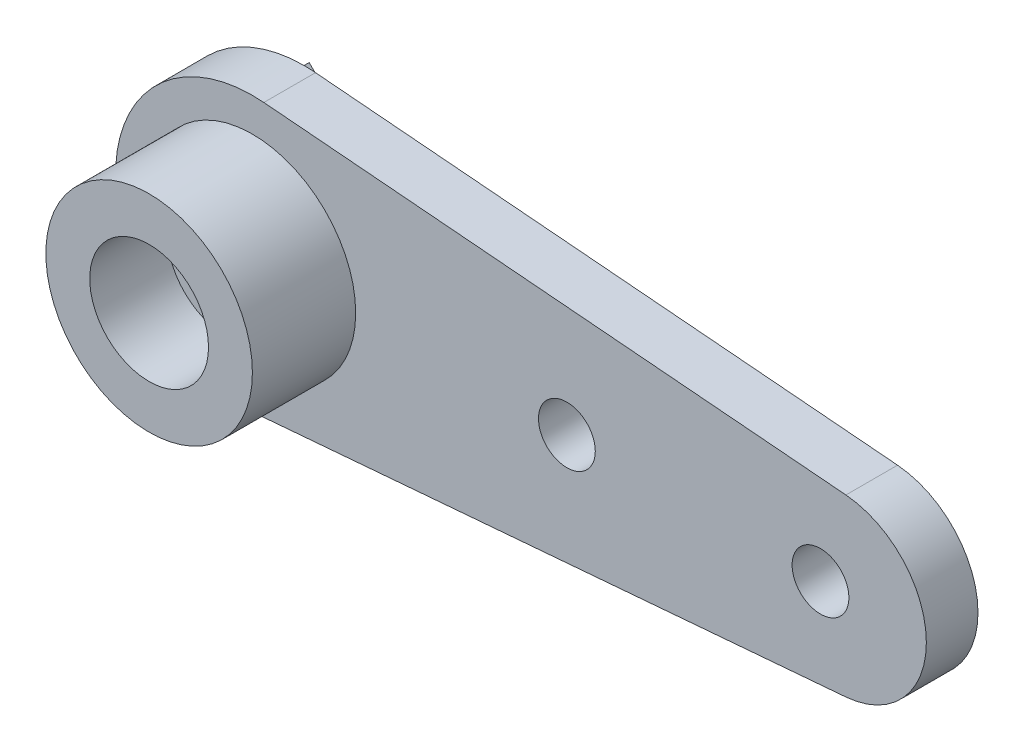
ISO-10303-21;
HEADER;
FILE_DESCRIPTION(('STEP AP214'),'2;1');
FILE_NAME('part.step','',(''),(''),'','','');
FILE_SCHEMA(('AUTOMOTIVE_DESIGN { 1 0 10303 214 1 1 1 1 }'));
ENDSEC;
DATA;
#1=APPLICATION_CONTEXT('core data for automotive mechanical design processes');
#2=APPLICATION_PROTOCOL_DEFINITION('international standard','automotive_design',2000,#1);
#3=PRODUCT_CONTEXT('',#1,'mechanical');
#4=PRODUCT('Part','Part','',(#3));
#5=PRODUCT_RELATED_PRODUCT_CATEGORY('part','',(#4));
#6=PRODUCT_DEFINITION_FORMATION('','',#4);
#7=PRODUCT_DEFINITION_CONTEXT('part definition',#1,'design');
#8=PRODUCT_DEFINITION('design','',#6,#7);
#9=PRODUCT_DEFINITION_SHAPE('','',#8);
#10=(LENGTH_UNIT() NAMED_UNIT(*) SI_UNIT(.MILLI.,.METRE.));
#11=(NAMED_UNIT(*) PLANE_ANGLE_UNIT() SI_UNIT($,.RADIAN.));
#12=(NAMED_UNIT(*) SI_UNIT($,.STERADIAN.) SOLID_ANGLE_UNIT());
#13=UNCERTAINTY_MEASURE_WITH_UNIT(LENGTH_MEASURE(1.E-05),#10,'distance_accuracy_value','');
#14=(GEOMETRIC_REPRESENTATION_CONTEXT(3) GLOBAL_UNCERTAINTY_ASSIGNED_CONTEXT((#13)) GLOBAL_UNIT_ASSIGNED_CONTEXT((#10,
#11,#12)) REPRESENTATION_CONTEXT('',''));
#15=CARTESIAN_POINT('',(0.,0.,0.));
#16=DIRECTION('',(0.,0.,1.));
#17=DIRECTION('',(1.,0.,0.));
#18=AXIS2_PLACEMENT_3D('',#15,#16,#17);
#19=CARTESIAN_POINT('',(0.,0.,0.));
#20=DIRECTION('',(0.,0.,1.));
#21=DIRECTION('',(1.,0.,0.));
#22=AXIS2_PLACEMENT_3D('',#19,#20,#21);
#23=PLANE('',#22);
#24=CARTESIAN_POINT('',(27.9406442711304,0.,0.));
#25=DIRECTION('',(0.,0.,1.));
#26=DIRECTION('',(1.,0.,0.));
#27=AXIS2_PLACEMENT_3D('',#24,#25,#26);
#28=CIRCLE('',#27,1.397);
#29=CARTESIAN_POINT('',(29.3376442711304,0.,0.));
#30=VERTEX_POINT('',#29);
#31=EDGE_CURVE('E169',#30,#30,#28,.T.);
#32=ORIENTED_EDGE('',*,*,#31,.T.);
#33=EDGE_LOOP('',(#32));
#34=FACE_BOUND('',#33,.T.);
#35=CARTESIAN_POINT('',(15.4667829245199,0.,0.));
#36=DIRECTION('',(0.,0.,1.));
#37=DIRECTION('',(1.,0.,0.));
#38=AXIS2_PLACEMENT_3D('',#35,#36,#37);
#39=CIRCLE('',#38,1.39699999999999);
#40=CARTESIAN_POINT('',(16.8637829245199,0.,0.));
#41=VERTEX_POINT('',#40);
#42=EDGE_CURVE('E166',#41,#41,#39,.T.);
#43=ORIENTED_EDGE('',*,*,#42,.T.);
#44=EDGE_LOOP('',(#43));
#45=FACE_BOUND('',#44,.T.);
#46=CARTESIAN_POINT('',(0.,0.,0.));
#47=DIRECTION('',(0.,0.,1.));
#48=DIRECTION('',(1.,0.,0.));
#49=AXIS2_PLACEMENT_3D('',#46,#47,#48);
#50=CIRCLE('',#49,2.921);
#51=CARTESIAN_POINT('',(2.921,0.,0.));
#52=VERTEX_POINT('',#51);
#53=EDGE_CURVE('E144',#52,#52,#50,.T.);
#54=ORIENTED_EDGE('',*,*,#53,.T.);
#55=EDGE_LOOP('',(#54));
#56=FACE_BOUND('',#55,.T.);
#57=DIRECTION('',(-0.707106781186546,0.707106781186549,0.));
#58=VECTOR('',#57,1.);
#59=CARTESIAN_POINT('',(-6.731,0.,0.));
#60=LINE('',#59,#58);
#61=CARTESIAN_POINT('',(-5.6149302763754,-1.11606972362461,0.));
#62=VERTEX_POINT('',#61);
#63=CARTESIAN_POINT('',(-6.731,0.,0.));
#64=VERTEX_POINT('',#63);
#65=EDGE_CURVE('E51',#62,#64,#60,.T.);
#66=ORIENTED_EDGE('',*,*,#65,.F.);
#67=DIRECTION('',(-0.707106781186549,-0.707106781186546,0.));
#68=VECTOR('',#67,1.);
#69=CARTESIAN_POINT('',(-5.6149302763754,-1.11606972362461,0.));
#70=LINE('',#69,#68);
#71=CARTESIAN_POINT('',(1.11606972362463,5.61493027637539,0.));
#72=VERTEX_POINT('',#71);
#73=EDGE_CURVE('E55',#72,#62,#70,.T.);
#74=ORIENTED_EDGE('',*,*,#73,.F.);
#75=DIRECTION('',(0.707106781186546,-0.707106781186549,0.));
#76=VECTOR('',#75,1.);
#77=CARTESIAN_POINT('',(1.11606972362463,5.61493027637539,0.));
#78=LINE('',#77,#76);
#79=CARTESIAN_POINT('',(0.,6.731,0.));
#80=VERTEX_POINT('',#79);
#81=EDGE_CURVE('E201',#80,#72,#78,.T.);
#82=ORIENTED_EDGE('',*,*,#81,.F.);
#83=CARTESIAN_POINT('',(0.,0.,0.));
#84=DIRECTION('',(0.,0.,1.));
#85=DIRECTION('',(1.,0.,0.));
#86=AXIS2_PLACEMENT_3D('',#83,#84,#85);
#87=CIRCLE('',#86,6.731);
#88=CARTESIAN_POINT('',(0.563387665198238,6.70738066153267,0.));
#89=VERTEX_POINT('',#88);
#90=EDGE_CURVE('E179',#89,#80,#87,.T.);
#91=ORIENTED_EDGE('',*,*,#90,.F.);
#92=DIRECTION('',(0.99649096145189,-0.0837004405286344,0.));
#93=VECTOR('',#92,1.);
#94=CARTESIAN_POINT('',(0.563387665198238,6.70738066153267,0.));
#95=LINE('',#94,#93);
#96=CARTESIAN_POINT('',(29.1904185022026,4.30284797154926,0.));
#97=VERTEX_POINT('',#96);
#98=EDGE_CURVE('E175',#89,#97,#95,.T.);
#99=ORIENTED_EDGE('',*,*,#98,.T.);
#100=CARTESIAN_POINT('',(28.829,0.,0.));
#101=DIRECTION('',(0.,0.,1.));
#102=DIRECTION('',(1.,0.,0.));
#103=AXIS2_PLACEMENT_3D('',#100,#101,#102);
#104=CIRCLE('',#103,4.318);
#105=CARTESIAN_POINT('',(29.1904185022026,-4.30284797154926,0.));
#106=VERTEX_POINT('',#105);
#107=EDGE_CURVE('E172',#106,#97,#104,.T.);
#108=ORIENTED_EDGE('',*,*,#107,.F.);
#109=DIRECTION('',(0.99649096145189,0.0837004405286343,0.));
#110=VECTOR('',#109,1.);
#111=CARTESIAN_POINT('',(0.563387665198237,-6.70738066153267,0.));
#112=LINE('',#111,#110);
#113=CARTESIAN_POINT('',(0.563387665198238,-6.70738066153267,0.));
#114=VERTEX_POINT('',#113);
#115=EDGE_CURVE('E151',#114,#106,#112,.T.);
#116=ORIENTED_EDGE('',*,*,#115,.F.);
#117=EDGE_CURVE('E178',#64,#114,#87,.T.);
#118=ORIENTED_EDGE('',*,*,#117,.F.);
#119=EDGE_LOOP('',(#66,#74,#82,#91,#99,#108,#116,#118));
#120=FACE_BOUND('',#119,.T.);
#121=ADVANCED_FACE('F36',(#34,#45,#56,#120),#23,.F.);
#122=DIRECTION('',(0.707106781186549,0.707106781186546,0.));
#123=VECTOR('',#122,1.);
#124=CARTESIAN_POINT('',(-6.731,0.,0.));
#125=LINE('',#124,#123);
#126=EDGE_CURVE('E209',#64,#80,#125,.T.);
#127=ORIENTED_EDGE('',*,*,#126,.F.);
#128=EDGE_CURVE('E181',#80,#64,#87,.T.);
#129=ORIENTED_EDGE('',*,*,#128,.F.);
#130=EDGE_LOOP('',(#127,#129));
#131=FACE_BOUND('',#130,.T.);
#132=ADVANCED_FACE('F208',(#131),#23,.F.);
#133=CARTESIAN_POINT('',(0.,0.,2.54));
#134=DIRECTION('',(0.,0.,-1.));
#135=DIRECTION('',(-1.,0.,0.));
#136=AXIS2_PLACEMENT_3D('',#133,#134,#135);
#137=CYLINDRICAL_SURFACE('',#136,2.921);
#138=ORIENTED_EDGE('',*,*,#53,.F.);
#139=EDGE_LOOP('',(#138));
#140=FACE_BOUND('',#139,.T.);
#141=CARTESIAN_POINT('',(0.,0.,2.54));
#142=DIRECTION('',(0.,0.,1.));
#143=DIRECTION('',(1.,0.,0.));
#144=AXIS2_PLACEMENT_3D('',#141,#142,#143);
#145=CIRCLE('',#144,2.921);
#146=CARTESIAN_POINT('',(2.921,0.,2.54));
#147=VERTEX_POINT('',#146);
#148=EDGE_CURVE('E133',#147,#147,#145,.T.);
#149=ORIENTED_EDGE('',*,*,#148,.T.);
#150=EDGE_LOOP('',(#149));
#151=FACE_BOUND('',#150,.T.);
#152=ADVANCED_FACE('F218',(#140,#151),#137,.F.);
#153=CARTESIAN_POINT('',(0.,0.,2.54));
#154=DIRECTION('',(0.,0.,1.));
#155=DIRECTION('',(1.,0.,0.));
#156=AXIS2_PLACEMENT_3D('',#153,#154,#155);
#157=PLANE('',#156);
#158=CARTESIAN_POINT('',(28.829,0.,2.54));
#159=DIRECTION('',(0.,0.,1.));
#160=DIRECTION('',(1.,0.,0.));
#161=AXIS2_PLACEMENT_3D('',#158,#159,#160);
#162=CIRCLE('',#161,4.318);
#163=CARTESIAN_POINT('',(29.1904185022026,-4.30284797154926,2.54));
#164=VERTEX_POINT('',#163);
#165=CARTESIAN_POINT('',(29.1904185022026,4.30284797154926,2.54));
#166=VERTEX_POINT('',#165);
#167=EDGE_CURVE('E154',#164,#166,#162,.T.);
#168=ORIENTED_EDGE('',*,*,#167,.T.);
#169=DIRECTION('',(0.99649096145189,-0.0837004405286344,0.));
#170=VECTOR('',#169,1.);
#171=CARTESIAN_POINT('',(0.563387665198238,6.70738066153267,2.54));
#172=LINE('',#171,#170);
#173=CARTESIAN_POINT('',(0.563387665198238,6.70738066153267,2.54));
#174=VERTEX_POINT('',#173);
#175=EDGE_CURVE('E156',#174,#166,#172,.T.);
#176=ORIENTED_EDGE('',*,*,#175,.F.);
#177=CARTESIAN_POINT('',(0.,0.,2.54));
#178=DIRECTION('',(0.,0.,1.));
#179=DIRECTION('',(1.,0.,0.));
#180=AXIS2_PLACEMENT_3D('',#177,#178,#179);
#181=CIRCLE('',#180,6.731);
#182=CARTESIAN_POINT('',(0.563387665198238,-6.70738066153267,2.54));
#183=VERTEX_POINT('',#182);
#184=EDGE_CURVE('E159',#174,#183,#181,.T.);
#185=ORIENTED_EDGE('',*,*,#184,.T.);
#186=DIRECTION('',(0.99649096145189,0.0837004405286343,0.));
#187=VECTOR('',#186,1.);
#188=CARTESIAN_POINT('',(0.563387665198237,-6.70738066153267,2.54));
#189=LINE('',#188,#187);
#190=EDGE_CURVE('E161',#183,#164,#189,.T.);
#191=ORIENTED_EDGE('',*,*,#190,.T.);
#192=EDGE_LOOP('',(#168,#176,#185,#191));
#193=FACE_BOUND('',#192,.T.);
#194=CARTESIAN_POINT('',(27.9406442711304,0.,2.54));
#195=DIRECTION('',(0.,0.,1.));
#196=DIRECTION('',(1.,0.,0.));
#197=AXIS2_PLACEMENT_3D('',#194,#195,#196);
#198=CIRCLE('',#197,1.397);
#199=CARTESIAN_POINT('',(29.3376442711304,0.,2.54));
#200=VERTEX_POINT('',#199);
#201=EDGE_CURVE('E150',#200,#200,#198,.T.);
#202=ORIENTED_EDGE('',*,*,#201,.F.);
#203=EDGE_LOOP('',(#202));
#204=FACE_BOUND('',#203,.T.);
#205=CARTESIAN_POINT('',(15.4667829245199,0.,2.54));
#206=DIRECTION('',(0.,0.,1.));
#207=DIRECTION('',(1.,0.,0.));
#208=AXIS2_PLACEMENT_3D('',#205,#206,#207);
#209=CIRCLE('',#208,1.39699999999999);
#210=CARTESIAN_POINT('',(16.8637829245199,0.,2.54));
#211=VERTEX_POINT('',#210);
#212=EDGE_CURVE('E147',#211,#211,#209,.T.);
#213=ORIENTED_EDGE('',*,*,#212,.F.);
#214=EDGE_LOOP('',(#213));
#215=FACE_BOUND('',#214,.T.);
#216=CARTESIAN_POINT('',(0.,0.,2.54));
#217=DIRECTION('',(0.,0.,1.));
#218=DIRECTION('',(1.,0.,0.));
#219=AXIS2_PLACEMENT_3D('',#216,#217,#218);
#220=CIRCLE('',#219,5.08);
#221=CARTESIAN_POINT('',(5.08,0.,2.54));
#222=VERTEX_POINT('',#221);
#223=EDGE_CURVE('E140',#222,#222,#220,.T.);
#224=ORIENTED_EDGE('',*,*,#223,.F.);
#225=EDGE_LOOP('',(#224));
#226=FACE_BOUND('',#225,.T.);
#227=ADVANCED_FACE('F215',(#193,#204,#215,#226),#157,.T.);
#228=CARTESIAN_POINT('',(28.829,0.,2.54));
#229=DIRECTION('',(0.,0.,-1.));
#230=DIRECTION('',(-1.,0.,0.));
#231=AXIS2_PLACEMENT_3D('',#228,#229,#230);
#232=CYLINDRICAL_SURFACE('',#231,4.318);
#233=ORIENTED_EDGE('',*,*,#107,.T.);
#234=DIRECTION('',(0.,0.,-1.));
#235=VECTOR('',#234,1.);
#236=CARTESIAN_POINT('',(29.1904185022026,4.30284797154926,2.54));
#237=LINE('',#236,#235);
#238=EDGE_CURVE('E44',#166,#97,#237,.T.);
#239=ORIENTED_EDGE('',*,*,#238,.F.);
#240=ORIENTED_EDGE('',*,*,#167,.F.);
#241=DIRECTION('',(0.,0.,-1.));
#242=VECTOR('',#241,1.);
#243=CARTESIAN_POINT('',(29.1904185022026,-4.30284797154926,2.54));
#244=LINE('',#243,#242);
#245=EDGE_CURVE('E163',#164,#106,#244,.T.);
#246=ORIENTED_EDGE('',*,*,#245,.T.);
#247=EDGE_LOOP('',(#233,#239,#240,#246));
#248=FACE_BOUND('',#247,.T.);
#249=ADVANCED_FACE('F197',(#248),#232,.T.);
#250=CARTESIAN_POINT('',(0.563387665198238,6.70738066153267,2.54));
#251=DIRECTION('',(0.0837004405286344,0.99649096145189,0.));
#252=DIRECTION('',(-0.99649096145189,0.0837004405286344,0.));
#253=AXIS2_PLACEMENT_3D('',#250,#251,#252);
#254=PLANE('',#253);
#255=ORIENTED_EDGE('',*,*,#98,.F.);
#256=DIRECTION('',(0.,0.,-1.));
#257=VECTOR('',#256,1.);
#258=CARTESIAN_POINT('',(0.563387665198238,6.70738066153267,2.54));
#259=LINE('',#258,#257);
#260=EDGE_CURVE('E188',#174,#89,#259,.T.);
#261=ORIENTED_EDGE('',*,*,#260,.F.);
#262=ORIENTED_EDGE('',*,*,#175,.T.);
#263=ORIENTED_EDGE('',*,*,#238,.T.);
#264=EDGE_LOOP('',(#255,#261,#262,#263));
#265=FACE_BOUND('',#264,.T.);
#266=ADVANCED_FACE('F192',(#265),#254,.T.);
#267=CARTESIAN_POINT('',(0.,0.,2.54));
#268=DIRECTION('',(0.,0.,-1.));
#269=DIRECTION('',(-1.,0.,0.));
#270=AXIS2_PLACEMENT_3D('',#267,#268,#269);
#271=CYLINDRICAL_SURFACE('',#270,6.731);
#272=ORIENTED_EDGE('',*,*,#90,.T.);
#273=ORIENTED_EDGE('',*,*,#128,.T.);
#274=ORIENTED_EDGE('',*,*,#117,.T.);
#275=DIRECTION('',(0.,0.,-1.));
#276=VECTOR('',#275,1.);
#277=CARTESIAN_POINT('',(0.563387665198238,-6.70738066153267,2.54));
#278=LINE('',#277,#276);
#279=EDGE_CURVE('E185',#183,#114,#278,.T.);
#280=ORIENTED_EDGE('',*,*,#279,.F.);
#281=ORIENTED_EDGE('',*,*,#184,.F.);
#282=ORIENTED_EDGE('',*,*,#260,.T.);
#283=EDGE_LOOP('',(#272,#273,#274,#280,#281,#282));
#284=FACE_BOUND('',#283,.T.);
#285=ADVANCED_FACE('F205',(#284),#271,.T.);
#286=CARTESIAN_POINT('',(27.9406442711304,0.,2.54));
#287=DIRECTION('',(0.,0.,-1.));
#288=DIRECTION('',(-1.,0.,0.));
#289=AXIS2_PLACEMENT_3D('',#286,#287,#288);
#290=CYLINDRICAL_SURFACE('',#289,1.397);
#291=ORIENTED_EDGE('',*,*,#201,.T.);
#292=EDGE_LOOP('',(#291));
#293=FACE_BOUND('',#292,.T.);
#294=ORIENTED_EDGE('',*,*,#31,.F.);
#295=EDGE_LOOP('',(#294));
#296=FACE_BOUND('',#295,.T.);
#297=ADVANCED_FACE('F254',(#293,#296),#290,.F.);
#298=CARTESIAN_POINT('',(15.4667829245199,0.,2.54));
#299=DIRECTION('',(0.,0.,-1.));
#300=DIRECTION('',(-1.,0.,0.));
#301=AXIS2_PLACEMENT_3D('',#298,#299,#300);
#302=CYLINDRICAL_SURFACE('',#301,1.39699999999999);
#303=ORIENTED_EDGE('',*,*,#212,.T.);
#304=EDGE_LOOP('',(#303));
#305=FACE_BOUND('',#304,.T.);
#306=ORIENTED_EDGE('',*,*,#42,.F.);
#307=EDGE_LOOP('',(#306));
#308=FACE_BOUND('',#307,.T.);
#309=ADVANCED_FACE('F260',(#305,#308),#302,.F.);
#310=CARTESIAN_POINT('',(0.,0.,3.81));
#311=DIRECTION('',(0.,0.,1.));
#312=DIRECTION('',(1.,0.,0.));
#313=AXIS2_PLACEMENT_3D('',#310,#311,#312);
#314=CIRCLE('',#313,2.921);
#315=CARTESIAN_POINT('',(2.921,0.,3.81));
#316=VERTEX_POINT('',#315);
#317=EDGE_CURVE('E11',#316,#316,#314,.T.);
#318=ORIENTED_EDGE('',*,*,#317,.F.);
#319=EDGE_LOOP('',(#318));
#320=FACE_BOUND('',#319,.T.);
#321=CARTESIAN_POINT('',(0.,0.,7.62));
#322=DIRECTION('',(0.,0.,1.));
#323=DIRECTION('',(1.,0.,0.));
#324=AXIS2_PLACEMENT_3D('',#321,#322,#323);
#325=CIRCLE('',#324,2.921);
#326=CARTESIAN_POINT('',(2.921,0.,7.62));
#327=VERTEX_POINT('',#326);
#328=EDGE_CURVE('E137',#327,#327,#325,.T.);
#329=ORIENTED_EDGE('',*,*,#328,.T.);
#330=EDGE_LOOP('',(#329));
#331=FACE_BOUND('',#330,.T.);
#332=ADVANCED_FACE('F38',(#320,#331),#137,.F.);
#333=CARTESIAN_POINT('',(0.563387665198237,-6.70738066153267,2.54));
#334=DIRECTION('',(-0.0837004405286343,0.99649096145189,0.));
#335=DIRECTION('',(-0.99649096145189,-0.0837004405286343,0.));
#336=AXIS2_PLACEMENT_3D('',#333,#334,#335);
#337=PLANE('',#336);
#338=ORIENTED_EDGE('',*,*,#115,.T.);
#339=ORIENTED_EDGE('',*,*,#245,.F.);
#340=ORIENTED_EDGE('',*,*,#190,.F.);
#341=ORIENTED_EDGE('',*,*,#279,.T.);
#342=EDGE_LOOP('',(#338,#339,#340,#341));
#343=FACE_BOUND('',#342,.T.);
#344=ADVANCED_FACE('F213',(#343),#337,.F.);
#345=CARTESIAN_POINT('',(0.,0.,7.62));
#346=DIRECTION('',(0.,0.,1.));
#347=DIRECTION('',(1.,0.,0.));
#348=AXIS2_PLACEMENT_3D('',#345,#346,#347);
#349=PLANE('',#348);
#350=CARTESIAN_POINT('',(0.,0.,7.62));
#351=DIRECTION('',(0.,0.,1.));
#352=DIRECTION('',(1.,0.,0.));
#353=AXIS2_PLACEMENT_3D('',#350,#351,#352);
#354=CIRCLE('',#353,5.08);
#355=CARTESIAN_POINT('',(5.08,0.,7.62));
#356=VERTEX_POINT('',#355);
#357=EDGE_CURVE('E141',#356,#356,#354,.T.);
#358=ORIENTED_EDGE('',*,*,#357,.T.);
#359=EDGE_LOOP('',(#358));
#360=FACE_BOUND('',#359,.T.);
#361=ORIENTED_EDGE('',*,*,#328,.F.);
#362=EDGE_LOOP('',(#361));
#363=FACE_BOUND('',#362,.T.);
#364=ADVANCED_FACE('F229',(#360,#363),#349,.T.);
#365=CARTESIAN_POINT('',(0.,0.,7.62));
#366=DIRECTION('',(0.,0.,-1.));
#367=DIRECTION('',(-1.,0.,0.));
#368=AXIS2_PLACEMENT_3D('',#365,#366,#367);
#369=CYLINDRICAL_SURFACE('',#368,5.08);
#370=ORIENTED_EDGE('',*,*,#357,.F.);
#371=EDGE_LOOP('',(#370));
#372=FACE_BOUND('',#371,.T.);
#373=ORIENTED_EDGE('',*,*,#223,.T.);
#374=EDGE_LOOP('',(#373));
#375=FACE_BOUND('',#374,.T.);
#376=ADVANCED_FACE('F226',(#372,#375),#369,.T.);
#377=CARTESIAN_POINT('',(0.,0.,3.81));
#378=DIRECTION('',(0.,0.,1.));
#379=DIRECTION('',(1.,0.,0.));
#380=AXIS2_PLACEMENT_3D('',#377,#378,#379);
#381=PLANE('',#380);
#382=ORIENTED_EDGE('',*,*,#317,.T.);
#383=EDGE_LOOP('',(#382));
#384=FACE_BOUND('',#383,.T.);
#385=CARTESIAN_POINT('',(0.,0.,3.81));
#386=DIRECTION('',(0.,0.,1.));
#387=DIRECTION('',(1.,0.,0.));
#388=AXIS2_PLACEMENT_3D('',#385,#386,#387);
#389=CIRCLE('',#388,1.8415);
#390=CARTESIAN_POINT('',(1.8415,0.,3.81));
#391=VERTEX_POINT('',#390);
#392=EDGE_CURVE('E126',#391,#391,#389,.T.);
#393=ORIENTED_EDGE('',*,*,#392,.F.);
#394=EDGE_LOOP('',(#393));
#395=FACE_BOUND('',#394,.T.);
#396=ADVANCED_FACE('F228',(#384,#395),#381,.T.);
#397=CARTESIAN_POINT('',(0.,0.,2.54));
#398=DIRECTION('',(0.,0.,1.));
#399=DIRECTION('',(1.,0.,0.));
#400=AXIS2_PLACEMENT_3D('',#397,#398,#399);
#401=PLANE('',#400);
#402=ORIENTED_EDGE('',*,*,#148,.F.);
#403=EDGE_LOOP('',(#402));
#404=FACE_BOUND('',#403,.T.);
#405=CARTESIAN_POINT('',(0.,0.,2.54));
#406=DIRECTION('',(0.,0.,1.));
#407=DIRECTION('',(1.,0.,0.));
#408=AXIS2_PLACEMENT_3D('',#405,#406,#407);
#409=CIRCLE('',#408,1.8415);
#410=CARTESIAN_POINT('',(1.8415,0.,2.54));
#411=VERTEX_POINT('',#410);
#412=EDGE_CURVE('E123',#411,#411,#409,.T.);
#413=ORIENTED_EDGE('',*,*,#412,.T.);
#414=EDGE_LOOP('',(#413));
#415=FACE_BOUND('',#414,.T.);
#416=ADVANCED_FACE('F236',(#404,#415),#401,.F.);
#417=CARTESIAN_POINT('',(0.,0.,3.81));
#418=DIRECTION('',(0.,0.,-1.));
#419=DIRECTION('',(-1.,0.,0.));
#420=AXIS2_PLACEMENT_3D('',#417,#418,#419);
#421=CYLINDRICAL_SURFACE('',#420,1.8415);
#422=ORIENTED_EDGE('',*,*,#392,.T.);
#423=EDGE_LOOP('',(#422));
#424=FACE_BOUND('',#423,.T.);
#425=ORIENTED_EDGE('',*,*,#412,.F.);
#426=EDGE_LOOP('',(#425));
#427=FACE_BOUND('',#426,.T.);
#428=ADVANCED_FACE('F279',(#424,#427),#421,.F.);
#429=CARTESIAN_POINT('',(-6.731,0.,-0.254));
#430=DIRECTION('',(0.707106781186549,0.707106781186546,0.));
#431=DIRECTION('',(-0.707106781186546,0.707106781186549,0.));
#432=AXIS2_PLACEMENT_3D('',#429,#430,#431);
#433=PLANE('',#432);
#434=ORIENTED_EDGE('',*,*,#65,.T.);
#435=DIRECTION('',(0.,0.,1.));
#436=VECTOR('',#435,1.);
#437=CARTESIAN_POINT('',(-6.731,0.,-0.254));
#438=LINE('',#437,#436);
#439=CARTESIAN_POINT('',(-6.731,0.,-0.254));
#440=VERTEX_POINT('',#439);
#441=EDGE_CURVE('E106',#440,#64,#438,.T.);
#442=ORIENTED_EDGE('',*,*,#441,.F.);
#443=DIRECTION('',(-0.707106781186546,0.707106781186549,0.));
#444=VECTOR('',#443,1.);
#445=CARTESIAN_POINT('',(-6.731,0.,-0.254));
#446=LINE('',#445,#444);
#447=CARTESIAN_POINT('',(-5.6149302763754,-1.11606972362461,-0.254));
#448=VERTEX_POINT('',#447);
#449=EDGE_CURVE('E112',#448,#440,#446,.T.);
#450=ORIENTED_EDGE('',*,*,#449,.F.);
#451=DIRECTION('',(0.,0.,1.));
#452=VECTOR('',#451,1.);
#453=CARTESIAN_POINT('',(-5.6149302763754,-1.11606972362461,-0.254));
#454=LINE('',#453,#452);
#455=EDGE_CURVE('E427',#448,#62,#454,.T.);
#456=ORIENTED_EDGE('',*,*,#455,.T.);
#457=EDGE_LOOP('',(#434,#442,#450,#456));
#458=FACE_BOUND('',#457,.T.);
#459=ADVANCED_FACE('F122',(#458),#433,.F.);
#460=CARTESIAN_POINT('',(-6.731,0.,-0.254));
#461=DIRECTION('',(0.707106781186546,-0.707106781186549,0.));
#462=DIRECTION('',(0.707106781186549,0.707106781186546,0.));
#463=AXIS2_PLACEMENT_3D('',#460,#461,#462);
#464=PLANE('',#463);
#465=ORIENTED_EDGE('',*,*,#126,.T.);
#466=DIRECTION('',(0.,0.,1.));
#467=VECTOR('',#466,1.);
#468=CARTESIAN_POINT('',(0.,6.731,-0.254));
#469=LINE('',#468,#467);
#470=CARTESIAN_POINT('',(0.,6.731,-0.254));
#471=VERTEX_POINT('',#470);
#472=EDGE_CURVE('E108',#471,#80,#469,.T.);
#473=ORIENTED_EDGE('',*,*,#472,.F.);
#474=DIRECTION('',(0.707106781186549,0.707106781186546,0.));
#475=VECTOR('',#474,1.);
#476=CARTESIAN_POINT('',(-6.731,0.,-0.254));
#477=LINE('',#476,#475);
#478=EDGE_CURVE('E101',#440,#471,#477,.T.);
#479=ORIENTED_EDGE('',*,*,#478,.F.);
#480=ORIENTED_EDGE('',*,*,#441,.T.);
#481=EDGE_LOOP('',(#465,#473,#479,#480));
#482=FACE_BOUND('',#481,.T.);
#483=ADVANCED_FACE('F104',(#482),#464,.F.);
#484=CARTESIAN_POINT('',(1.11606972362463,5.61493027637539,-0.254));
#485=DIRECTION('',(-0.707106781186549,-0.707106781186546,0.));
#486=DIRECTION('',(0.707106781186546,-0.707106781186549,0.));
#487=AXIS2_PLACEMENT_3D('',#484,#485,#486);
#488=PLANE('',#487);
#489=ORIENTED_EDGE('',*,*,#81,.T.);
#490=DIRECTION('',(0.,0.,1.));
#491=VECTOR('',#490,1.);
#492=CARTESIAN_POINT('',(1.11606972362463,5.61493027637539,-0.254));
#493=LINE('',#492,#491);
#494=CARTESIAN_POINT('',(1.11606972362463,5.61493027637539,-0.254));
#495=VERTEX_POINT('',#494);
#496=EDGE_CURVE('E128',#495,#72,#493,.T.);
#497=ORIENTED_EDGE('',*,*,#496,.F.);
#498=DIRECTION('',(0.707106781186546,-0.707106781186549,0.));
#499=VECTOR('',#498,1.);
#500=CARTESIAN_POINT('',(1.11606972362463,5.61493027637539,-0.254));
#501=LINE('',#500,#499);
#502=EDGE_CURVE('E111',#471,#495,#501,.T.);
#503=ORIENTED_EDGE('',*,*,#502,.F.);
#504=ORIENTED_EDGE('',*,*,#472,.T.);
#505=EDGE_LOOP('',(#489,#497,#503,#504));
#506=FACE_BOUND('',#505,.T.);
#507=ADVANCED_FACE('F293',(#506),#488,.F.);
#508=CARTESIAN_POINT('',(-5.6149302763754,-1.11606972362461,-0.254));
#509=DIRECTION('',(-0.707106781186546,0.707106781186549,0.));
#510=DIRECTION('',(-0.707106781186549,-0.707106781186546,0.));
#511=AXIS2_PLACEMENT_3D('',#508,#509,#510);
#512=PLANE('',#511);
#513=ORIENTED_EDGE('',*,*,#73,.T.);
#514=ORIENTED_EDGE('',*,*,#455,.F.);
#515=DIRECTION('',(-0.707106781186549,-0.707106781186546,0.));
#516=VECTOR('',#515,1.);
#517=CARTESIAN_POINT('',(-5.6149302763754,-1.11606972362461,-0.254));
#518=LINE('',#517,#516);
#519=EDGE_CURVE('E117',#495,#448,#518,.T.);
#520=ORIENTED_EDGE('',*,*,#519,.F.);
#521=ORIENTED_EDGE('',*,*,#496,.T.);
#522=EDGE_LOOP('',(#513,#514,#520,#521));
#523=FACE_BOUND('',#522,.T.);
#524=ADVANCED_FACE('F296',(#523),#512,.F.);
#525=CARTESIAN_POINT('',(0.,0.,-0.254));
#526=DIRECTION('',(0.,0.,1.));
#527=DIRECTION('',(1.,0.,0.));
#528=AXIS2_PLACEMENT_3D('',#525,#526,#527);
#529=PLANE('',#528);
#530=ORIENTED_EDGE('',*,*,#449,.T.);
#531=ORIENTED_EDGE('',*,*,#478,.T.);
#532=ORIENTED_EDGE('',*,*,#502,.T.);
#533=ORIENTED_EDGE('',*,*,#519,.T.);
#534=EDGE_LOOP('',(#530,#531,#532,#533));
#535=FACE_BOUND('',#534,.T.);
#536=ADVANCED_FACE('F115',(#535),#529,.F.);
#537=CLOSED_SHELL('',(#121,#132,#152,#227,#249,#266,#285,#297,#309,#332,#344,#364,#376,#396,
#416,#428,#459,#483,#507,#524,#536));
#538=MANIFOLD_SOLID_BREP('B2',#537);
#539=ADVANCED_BREP_SHAPE_REPRESENTATION('',(#18,#538),#14);
#540=SHAPE_DEFINITION_REPRESENTATION(#9,#539);
ENDSEC;
END-ISO-10303-21;
